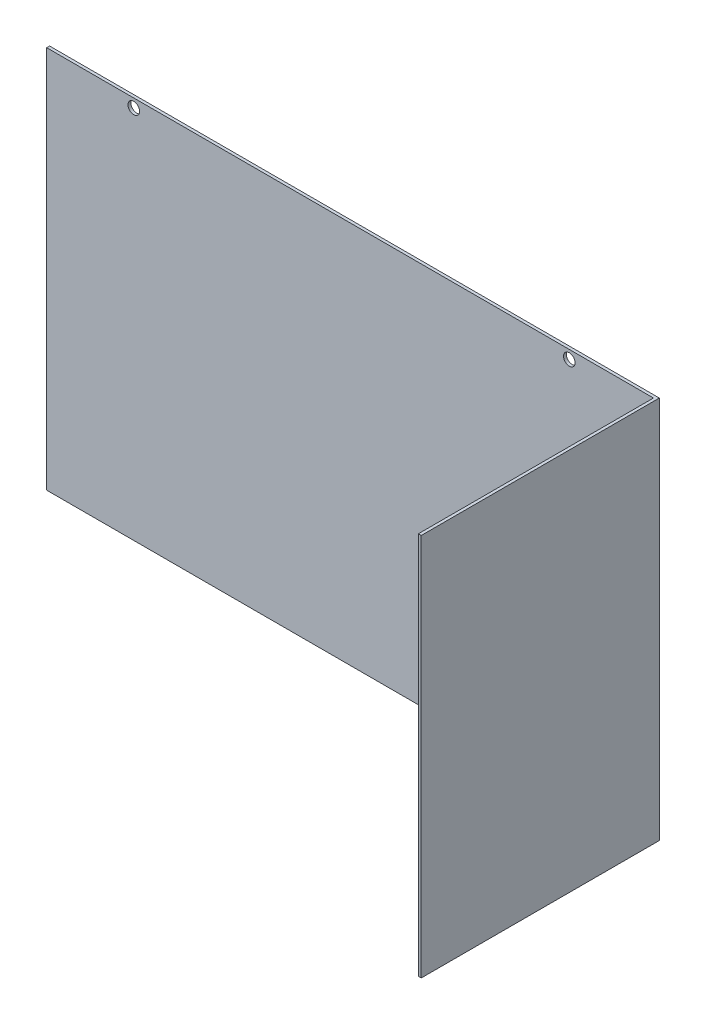
ISO-10303-21;
HEADER;
FILE_DESCRIPTION(('STEP AP214'),'2;1');
FILE_NAME('part.step','',(''),(''),'','','');
FILE_SCHEMA(('AUTOMOTIVE_DESIGN { 1 0 10303 214 1 1 1 1 }'));
ENDSEC;
DATA;
#1=APPLICATION_CONTEXT('core data for automotive mechanical design processes');
#2=APPLICATION_PROTOCOL_DEFINITION('international standard','automotive_design',2000,#1);
#3=PRODUCT_CONTEXT('',#1,'mechanical');
#4=PRODUCT('Part','Part','',(#3));
#5=PRODUCT_RELATED_PRODUCT_CATEGORY('part','',(#4));
#6=PRODUCT_DEFINITION_FORMATION('','',#4);
#7=PRODUCT_DEFINITION_CONTEXT('part definition',#1,'design');
#8=PRODUCT_DEFINITION('design','',#6,#7);
#9=PRODUCT_DEFINITION_SHAPE('','',#8);
#10=(LENGTH_UNIT() NAMED_UNIT(*) SI_UNIT(.MILLI.,.METRE.));
#11=(NAMED_UNIT(*) PLANE_ANGLE_UNIT() SI_UNIT($,.RADIAN.));
#12=(NAMED_UNIT(*) SI_UNIT($,.STERADIAN.) SOLID_ANGLE_UNIT());
#13=UNCERTAINTY_MEASURE_WITH_UNIT(LENGTH_MEASURE(1.E-05),#10,'distance_accuracy_value','');
#14=(GEOMETRIC_REPRESENTATION_CONTEXT(3) GLOBAL_UNCERTAINTY_ASSIGNED_CONTEXT((#13)) GLOBAL_UNIT_ASSIGNED_CONTEXT((#10,
#11,#12)) REPRESENTATION_CONTEXT('',''));
#15=CARTESIAN_POINT('',(0.,0.,0.));
#16=DIRECTION('',(0.,0.,1.));
#17=DIRECTION('',(1.,0.,0.));
#18=AXIS2_PLACEMENT_3D('',#15,#16,#17);
#19=CARTESIAN_POINT('',(0.,0.,1.));
#20=DIRECTION('',(0.,0.,-1.));
#21=DIRECTION('',(-1.,0.,0.));
#22=AXIS2_PLACEMENT_3D('',#19,#20,#21);
#23=PLANE('',#22);
#24=CARTESIAN_POINT('',(75.,63.,1.));
#25=DIRECTION('',(0.,0.,1.));
#26=DIRECTION('',(1.,0.,0.));
#27=AXIS2_PLACEMENT_3D('',#24,#25,#26);
#28=CIRCLE('',#27,2.);
#29=CARTESIAN_POINT('',(77.,63.,1.));
#30=VERTEX_POINT('',#29);
#31=EDGE_CURVE('E146',#30,#30,#28,.T.);
#32=ORIENTED_EDGE('',*,*,#31,.F.);
#33=EDGE_LOOP('',(#32));
#34=FACE_BOUND('',#33,.T.);
#35=CARTESIAN_POINT('',(-75.,63.,1.));
#36=DIRECTION('',(0.,0.,1.));
#37=DIRECTION('',(1.,0.,0.));
#38=AXIS2_PLACEMENT_3D('',#35,#36,#37);
#39=CIRCLE('',#38,2.);
#40=CARTESIAN_POINT('',(-73.,63.,1.));
#41=VERTEX_POINT('',#40);
#42=EDGE_CURVE('E140',#41,#41,#39,.T.);
#43=ORIENTED_EDGE('',*,*,#42,.F.);
#44=EDGE_LOOP('',(#43));
#45=FACE_BOUND('',#44,.T.);
#46=DIRECTION('',(0.,-1.,0.));
#47=VECTOR('',#46,1.);
#48=CARTESIAN_POINT('',(104.,66.,1.));
#49=LINE('',#48,#47);
#50=CARTESIAN_POINT('',(104.,66.,1.));
#51=VERTEX_POINT('',#50);
#52=CARTESIAN_POINT('',(104.,-66.,1.));
#53=VERTEX_POINT('',#52);
#54=EDGE_CURVE('E50',#51,#53,#49,.T.);
#55=ORIENTED_EDGE('',*,*,#54,.F.);
#56=DIRECTION('',(-1.,0.,0.));
#57=VECTOR('',#56,1.);
#58=CARTESIAN_POINT('',(-105.,66.,1.));
#59=LINE('',#58,#57);
#60=CARTESIAN_POINT('',(-105.,66.,1.));
#61=VERTEX_POINT('',#60);
#62=EDGE_CURVE('E55',#51,#61,#59,.T.);
#63=ORIENTED_EDGE('',*,*,#62,.T.);
#64=DIRECTION('',(0.,-1.,0.));
#65=VECTOR('',#64,1.);
#66=CARTESIAN_POINT('',(-105.,-66.,1.));
#67=LINE('',#66,#65);
#68=CARTESIAN_POINT('',(-105.,-66.,1.));
#69=VERTEX_POINT('',#68);
#70=EDGE_CURVE('E86',#61,#69,#67,.T.);
#71=ORIENTED_EDGE('',*,*,#70,.T.);
#72=DIRECTION('',(1.,0.,0.));
#73=VECTOR('',#72,1.);
#74=CARTESIAN_POINT('',(-105.,-66.,1.));
#75=LINE('',#74,#73);
#76=EDGE_CURVE('E110',#69,#53,#75,.T.);
#77=ORIENTED_EDGE('',*,*,#76,.T.);
#78=EDGE_LOOP('',(#55,#63,#71,#77));
#79=FACE_BOUND('',#78,.T.);
#80=ADVANCED_FACE('F33',(#34,#45,#79),#23,.F.);
#81=CARTESIAN_POINT('',(-105.,-66.,1.));
#82=DIRECTION('',(1.,0.,0.));
#83=DIRECTION('',(0.,0.,-1.));
#84=AXIS2_PLACEMENT_3D('',#81,#82,#83);
#85=PLANE('',#84);
#86=DIRECTION('',(0.,-1.,0.));
#87=VECTOR('',#86,1.);
#88=CARTESIAN_POINT('',(-105.,-66.,0.));
#89=LINE('',#88,#87);
#90=CARTESIAN_POINT('',(-105.,66.,0.));
#91=VERTEX_POINT('',#90);
#92=CARTESIAN_POINT('',(-105.,-66.,0.));
#93=VERTEX_POINT('',#92);
#94=EDGE_CURVE('E92',#91,#93,#89,.T.);
#95=ORIENTED_EDGE('',*,*,#94,.T.);
#96=DIRECTION('',(0.,0.,-1.));
#97=VECTOR('',#96,1.);
#98=CARTESIAN_POINT('',(-105.,-66.,1.));
#99=LINE('',#98,#97);
#100=EDGE_CURVE('E11',#69,#93,#99,.T.);
#101=ORIENTED_EDGE('',*,*,#100,.F.);
#102=ORIENTED_EDGE('',*,*,#70,.F.);
#103=DIRECTION('',(0.,0.,-1.));
#104=VECTOR('',#103,1.);
#105=CARTESIAN_POINT('',(-105.,66.,1.));
#106=LINE('',#105,#104);
#107=EDGE_CURVE('E78',#61,#91,#106,.T.);
#108=ORIENTED_EDGE('',*,*,#107,.T.);
#109=EDGE_LOOP('',(#95,#101,#102,#108));
#110=FACE_BOUND('',#109,.T.);
#111=ADVANCED_FACE('F35',(#110),#85,.F.);
#112=CARTESIAN_POINT('',(-105.,-66.,1.));
#113=DIRECTION('',(0.,1.,0.));
#114=DIRECTION('',(0.,0.,1.));
#115=AXIS2_PLACEMENT_3D('',#112,#113,#114);
#116=PLANE('',#115);
#117=DIRECTION('',(1.,0.,0.));
#118=VECTOR('',#117,1.);
#119=CARTESIAN_POINT('',(-105.,-66.,0.));
#120=LINE('',#119,#118);
#121=CARTESIAN_POINT('',(105.,-66.,0.));
#122=VERTEX_POINT('',#121);
#123=EDGE_CURVE('E95',#93,#122,#120,.T.);
#124=ORIENTED_EDGE('',*,*,#123,.T.);
#125=DIRECTION('',(0.,0.,-1.));
#126=VECTOR('',#125,1.);
#127=CARTESIAN_POINT('',(105.,-66.,1.));
#128=LINE('',#127,#126);
#129=CARTESIAN_POINT('',(105.,-66.,82.));
#130=VERTEX_POINT('',#129);
#131=EDGE_CURVE('E42',#130,#122,#128,.T.);
#132=ORIENTED_EDGE('',*,*,#131,.F.);
#133=DIRECTION('',(1.,0.,0.));
#134=VECTOR('',#133,1.);
#135=CARTESIAN_POINT('',(104.,-66.,82.));
#136=LINE('',#135,#134);
#137=CARTESIAN_POINT('',(104.,-66.,82.));
#138=VERTEX_POINT('',#137);
#139=EDGE_CURVE('E133',#138,#130,#136,.T.);
#140=ORIENTED_EDGE('',*,*,#139,.F.);
#141=DIRECTION('',(0.,0.,-1.));
#142=VECTOR('',#141,1.);
#143=CARTESIAN_POINT('',(104.,-66.,82.));
#144=LINE('',#143,#142);
#145=EDGE_CURVE('E96',#138,#53,#144,.T.);
#146=ORIENTED_EDGE('',*,*,#145,.T.);
#147=ORIENTED_EDGE('',*,*,#76,.F.);
#148=ORIENTED_EDGE('',*,*,#100,.T.);
#149=EDGE_LOOP('',(#124,#132,#140,#146,#147,#148));
#150=FACE_BOUND('',#149,.T.);
#151=ADVANCED_FACE('F185',(#150),#116,.F.);
#152=CARTESIAN_POINT('',(105.,-66.,1.));
#153=DIRECTION('',(-1.,0.,0.));
#154=DIRECTION('',(0.,-1.,0.));
#155=AXIS2_PLACEMENT_3D('',#152,#153,#154);
#156=PLANE('',#155);
#157=DIRECTION('',(0.,1.,0.));
#158=VECTOR('',#157,1.);
#159=CARTESIAN_POINT('',(105.,-66.,0.));
#160=LINE('',#159,#158);
#161=CARTESIAN_POINT('',(105.,66.,0.));
#162=VERTEX_POINT('',#161);
#163=EDGE_CURVE('E87',#122,#162,#160,.T.);
#164=ORIENTED_EDGE('',*,*,#163,.T.);
#165=DIRECTION('',(0.,0.,-1.));
#166=VECTOR('',#165,1.);
#167=CARTESIAN_POINT('',(105.,66.,1.));
#168=LINE('',#167,#166);
#169=CARTESIAN_POINT('',(105.,66.,82.));
#170=VERTEX_POINT('',#169);
#171=EDGE_CURVE('E82',#170,#162,#168,.T.);
#172=ORIENTED_EDGE('',*,*,#171,.F.);
#173=DIRECTION('',(0.,1.,0.));
#174=VECTOR('',#173,1.);
#175=CARTESIAN_POINT('',(105.,66.,82.));
#176=LINE('',#175,#174);
#177=EDGE_CURVE('E129',#130,#170,#176,.T.);
#178=ORIENTED_EDGE('',*,*,#177,.F.);
#179=ORIENTED_EDGE('',*,*,#131,.T.);
#180=EDGE_LOOP('',(#164,#172,#178,#179));
#181=FACE_BOUND('',#180,.T.);
#182=ADVANCED_FACE('F183',(#181),#156,.F.);
#183=CARTESIAN_POINT('',(-105.,66.,1.));
#184=DIRECTION('',(0.,-1.,0.));
#185=DIRECTION('',(1.,0.,0.));
#186=AXIS2_PLACEMENT_3D('',#183,#184,#185);
#187=PLANE('',#186);
#188=DIRECTION('',(-1.,0.,0.));
#189=VECTOR('',#188,1.);
#190=CARTESIAN_POINT('',(-105.,66.,0.));
#191=LINE('',#190,#189);
#192=EDGE_CURVE('E75',#162,#91,#191,.T.);
#193=ORIENTED_EDGE('',*,*,#192,.T.);
#194=ORIENTED_EDGE('',*,*,#107,.F.);
#195=ORIENTED_EDGE('',*,*,#62,.F.);
#196=DIRECTION('',(0.,0.,-1.));
#197=VECTOR('',#196,1.);
#198=CARTESIAN_POINT('',(104.,66.,82.));
#199=LINE('',#198,#197);
#200=CARTESIAN_POINT('',(104.,66.,82.));
#201=VERTEX_POINT('',#200);
#202=EDGE_CURVE('E100',#201,#51,#199,.T.);
#203=ORIENTED_EDGE('',*,*,#202,.F.);
#204=DIRECTION('',(-1.,0.,0.));
#205=VECTOR('',#204,1.);
#206=CARTESIAN_POINT('',(104.,66.,82.));
#207=LINE('',#206,#205);
#208=EDGE_CURVE('E117',#170,#201,#207,.T.);
#209=ORIENTED_EDGE('',*,*,#208,.F.);
#210=ORIENTED_EDGE('',*,*,#171,.T.);
#211=EDGE_LOOP('',(#193,#194,#195,#203,#209,#210));
#212=FACE_BOUND('',#211,.T.);
#213=ADVANCED_FACE('F77',(#212),#187,.F.);
#214=CARTESIAN_POINT('',(0.,0.,0.));
#215=DIRECTION('',(0.,0.,-1.));
#216=DIRECTION('',(-1.,0.,0.));
#217=AXIS2_PLACEMENT_3D('',#214,#215,#216);
#218=PLANE('',#217);
#219=CARTESIAN_POINT('',(75.,63.,0.));
#220=DIRECTION('',(0.,0.,1.));
#221=DIRECTION('',(1.,0.,0.));
#222=AXIS2_PLACEMENT_3D('',#219,#220,#221);
#223=CIRCLE('',#222,2.);
#224=CARTESIAN_POINT('',(77.,63.,0.));
#225=VERTEX_POINT('',#224);
#226=EDGE_CURVE('E143',#225,#225,#223,.T.);
#227=ORIENTED_EDGE('',*,*,#226,.T.);
#228=EDGE_LOOP('',(#227));
#229=FACE_BOUND('',#228,.T.);
#230=CARTESIAN_POINT('',(-75.,63.,0.));
#231=DIRECTION('',(0.,0.,1.));
#232=DIRECTION('',(1.,0.,0.));
#233=AXIS2_PLACEMENT_3D('',#230,#231,#232);
#234=CIRCLE('',#233,2.);
#235=CARTESIAN_POINT('',(-73.,63.,0.));
#236=VERTEX_POINT('',#235);
#237=EDGE_CURVE('E122',#236,#236,#234,.T.);
#238=ORIENTED_EDGE('',*,*,#237,.T.);
#239=EDGE_LOOP('',(#238));
#240=FACE_BOUND('',#239,.T.);
#241=ORIENTED_EDGE('',*,*,#94,.F.);
#242=ORIENTED_EDGE('',*,*,#192,.F.);
#243=ORIENTED_EDGE('',*,*,#163,.F.);
#244=ORIENTED_EDGE('',*,*,#123,.F.);
#245=EDGE_LOOP('',(#241,#242,#243,#244));
#246=FACE_BOUND('',#245,.T.);
#247=ADVANCED_FACE('F94',(#229,#240,#246),#218,.T.);
#248=CARTESIAN_POINT('',(104.,66.,82.));
#249=DIRECTION('',(1.,0.,0.));
#250=DIRECTION('',(0.,0.,-1.));
#251=AXIS2_PLACEMENT_3D('',#248,#249,#250);
#252=PLANE('',#251);
#253=ORIENTED_EDGE('',*,*,#54,.T.);
#254=ORIENTED_EDGE('',*,*,#145,.F.);
#255=DIRECTION('',(0.,-1.,0.));
#256=VECTOR('',#255,1.);
#257=CARTESIAN_POINT('',(104.,66.,82.));
#258=LINE('',#257,#256);
#259=EDGE_CURVE('E121',#201,#138,#258,.T.);
#260=ORIENTED_EDGE('',*,*,#259,.F.);
#261=ORIENTED_EDGE('',*,*,#202,.T.);
#262=EDGE_LOOP('',(#253,#254,#260,#261));
#263=FACE_BOUND('',#262,.T.);
#264=ADVANCED_FACE('F173',(#263),#252,.F.);
#265=CARTESIAN_POINT('',(0.,0.,82.));
#266=DIRECTION('',(0.,0.,1.));
#267=DIRECTION('',(1.,0.,0.));
#268=AXIS2_PLACEMENT_3D('',#265,#266,#267);
#269=PLANE('',#268);
#270=ORIENTED_EDGE('',*,*,#259,.T.);
#271=ORIENTED_EDGE('',*,*,#139,.T.);
#272=ORIENTED_EDGE('',*,*,#177,.T.);
#273=ORIENTED_EDGE('',*,*,#208,.T.);
#274=EDGE_LOOP('',(#270,#271,#272,#273));
#275=FACE_BOUND('',#274,.T.);
#276=ADVANCED_FACE('F167',(#275),#269,.T.);
#277=CARTESIAN_POINT('',(-75.,63.,0.));
#278=DIRECTION('',(0.,0.,1.));
#279=DIRECTION('',(1.,0.,0.));
#280=AXIS2_PLACEMENT_3D('',#277,#278,#279);
#281=CYLINDRICAL_SURFACE('',#280,2.);
#282=ORIENTED_EDGE('',*,*,#237,.F.);
#283=EDGE_LOOP('',(#282));
#284=FACE_BOUND('',#283,.T.);
#285=ORIENTED_EDGE('',*,*,#42,.T.);
#286=EDGE_LOOP('',(#285));
#287=FACE_BOUND('',#286,.T.);
#288=ADVANCED_FACE('F157',(#284,#287),#281,.F.);
#289=CARTESIAN_POINT('',(75.,63.,0.));
#290=DIRECTION('',(0.,0.,1.));
#291=DIRECTION('',(1.,0.,0.));
#292=AXIS2_PLACEMENT_3D('',#289,#290,#291);
#293=CYLINDRICAL_SURFACE('',#292,2.);
#294=ORIENTED_EDGE('',*,*,#226,.F.);
#295=EDGE_LOOP('',(#294));
#296=FACE_BOUND('',#295,.T.);
#297=ORIENTED_EDGE('',*,*,#31,.T.);
#298=EDGE_LOOP('',(#297));
#299=FACE_BOUND('',#298,.T.);
#300=ADVANCED_FACE('F154',(#296,#299),#293,.F.);
#301=CLOSED_SHELL('',(#80,#111,#151,#182,#213,#247,#264,#276,#288,#300));
#302=MANIFOLD_SOLID_BREP('B2',#301);
#303=ADVANCED_BREP_SHAPE_REPRESENTATION('',(#18,#302),#14);
#304=SHAPE_DEFINITION_REPRESENTATION(#9,#303);
ENDSEC;
END-ISO-10303-21;
